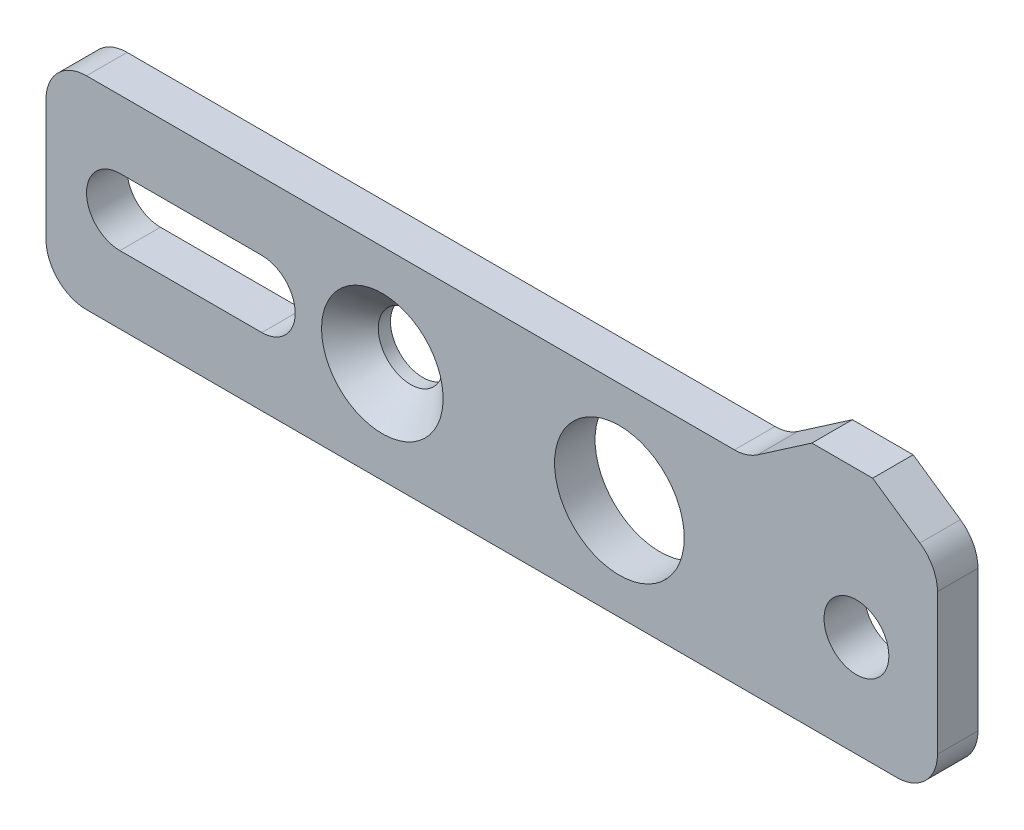
ISO-10303-21;
HEADER;
FILE_DESCRIPTION(('STEP AP214'),'2;1');
FILE_NAME('part.step','',(''),(''),'','','');
FILE_SCHEMA(('AUTOMOTIVE_DESIGN { 1 0 10303 214 1 1 1 1 }'));
ENDSEC;
DATA;
#1=APPLICATION_CONTEXT('core data for automotive mechanical design processes');
#2=APPLICATION_PROTOCOL_DEFINITION('international standard','automotive_design',2000,#1);
#3=PRODUCT_CONTEXT('',#1,'mechanical');
#4=PRODUCT('Part','Part','',(#3));
#5=PRODUCT_RELATED_PRODUCT_CATEGORY('part','',(#4));
#6=PRODUCT_DEFINITION_FORMATION('','',#4);
#7=PRODUCT_DEFINITION_CONTEXT('part definition',#1,'design');
#8=PRODUCT_DEFINITION('design','',#6,#7);
#9=PRODUCT_DEFINITION_SHAPE('','',#8);
#10=(LENGTH_UNIT() NAMED_UNIT(*) SI_UNIT(.MILLI.,.METRE.));
#11=(NAMED_UNIT(*) PLANE_ANGLE_UNIT() SI_UNIT($,.RADIAN.));
#12=(NAMED_UNIT(*) SI_UNIT($,.STERADIAN.) SOLID_ANGLE_UNIT());
#13=UNCERTAINTY_MEASURE_WITH_UNIT(LENGTH_MEASURE(1.E-05),#10,'distance_accuracy_value','');
#14=(GEOMETRIC_REPRESENTATION_CONTEXT(3) GLOBAL_UNCERTAINTY_ASSIGNED_CONTEXT((#13)) GLOBAL_UNIT_ASSIGNED_CONTEXT((#10,
#11,#12)) REPRESENTATION_CONTEXT('',''));
#15=CARTESIAN_POINT('',(0.,0.,0.));
#16=DIRECTION('',(0.,0.,1.));
#17=DIRECTION('',(1.,0.,0.));
#18=AXIS2_PLACEMENT_3D('',#15,#16,#17);
#19=CARTESIAN_POINT('',(62.9999999999999,25.,-10.));
#20=DIRECTION('',(0.,1.,0.));
#21=DIRECTION('',(-1.,0.,0.));
#22=AXIS2_PLACEMENT_3D('',#19,#20,#21);
#23=PLANE('',#22);
#24=DIRECTION('',(-1.,0.,0.));
#25=VECTOR('',#24,1.);
#26=CARTESIAN_POINT('',(62.9999999999999,25.,0.));
#27=LINE('',#26,#25);
#28=CARTESIAN_POINT('',(59.894101964593,25.,0.));
#29=VERTEX_POINT('',#28);
#30=CARTESIAN_POINT('',(-100.,25.,0.));
#31=VERTEX_POINT('',#30);
#32=EDGE_CURVE('E198',#29,#31,#27,.T.);
#33=ORIENTED_EDGE('',*,*,#32,.F.);
#34=DIRECTION('',(0.,0.,1.));
#35=VECTOR('',#34,1.);
#36=CARTESIAN_POINT('',(59.894101964593,25.,-10.));
#37=LINE('',#36,#35);
#38=CARTESIAN_POINT('',(59.894101964593,25.,-10.));
#39=VERTEX_POINT('',#38);
#40=EDGE_CURVE('E257',#29,#39,#37,.F.);
#41=ORIENTED_EDGE('',*,*,#40,.T.);
#42=DIRECTION('',(-1.,0.,0.));
#43=VECTOR('',#42,1.);
#44=CARTESIAN_POINT('',(62.9999999999999,25.,-10.));
#45=LINE('',#44,#43);
#46=CARTESIAN_POINT('',(-100.,25.,-10.));
#47=VERTEX_POINT('',#46);
#48=EDGE_CURVE('E202',#39,#47,#45,.T.);
#49=ORIENTED_EDGE('',*,*,#48,.T.);
#50=DIRECTION('',(0.,0.,1.));
#51=VECTOR('',#50,1.);
#52=CARTESIAN_POINT('',(-100.,25.,-10.));
#53=LINE('',#52,#51);
#54=EDGE_CURVE('E254',#47,#31,#53,.T.);
#55=ORIENTED_EDGE('',*,*,#54,.T.);
#56=EDGE_LOOP('',(#33,#41,#49,#55));
#57=FACE_BOUND('',#56,.T.);
#58=ADVANCED_FACE('F42',(#57),#23,.T.);
#59=CARTESIAN_POINT('',(78.9999999999999,36.0000000000001,-10.));
#60=DIRECTION('',(-0.566528822887066,0.824041924199367,0.));
#61=DIRECTION('',(-0.824041924199367,-0.566528822887066,0.));
#62=AXIS2_PLACEMENT_3D('',#59,#60,#61);
#63=PLANE('',#62);
#64=DIRECTION('',(-0.824041924199367,-0.566528822887066,0.));
#65=VECTOR('',#64,1.);
#66=CARTESIAN_POINT('',(78.9999999999999,36.0000000000001,-10.));
#67=LINE('',#66,#65);
#68=CARTESIAN_POINT('',(78.9999999999999,36.0000000000001,-10.));
#69=VERTEX_POINT('',#68);
#70=CARTESIAN_POINT('',(65.5593901934636,26.7595807580064,-10.));
#71=VERTEX_POINT('',#70);
#72=EDGE_CURVE('E219',#69,#71,#67,.T.);
#73=ORIENTED_EDGE('',*,*,#72,.T.);
#74=DIRECTION('',(0.,0.,1.));
#75=VECTOR('',#74,1.);
#76=CARTESIAN_POINT('',(65.5593901934636,26.7595807580064,0.));
#77=LINE('',#76,#75);
#78=CARTESIAN_POINT('',(65.5593901934636,26.7595807580064,0.));
#79=VERTEX_POINT('',#78);
#80=EDGE_CURVE('E251',#71,#79,#77,.T.);
#81=ORIENTED_EDGE('',*,*,#80,.T.);
#82=DIRECTION('',(-0.824041924199367,-0.566528822887066,0.));
#83=VECTOR('',#82,1.);
#84=CARTESIAN_POINT('',(78.9999999999999,36.0000000000001,0.));
#85=LINE('',#84,#83);
#86=CARTESIAN_POINT('',(78.9999999999999,36.0000000000001,0.));
#87=VERTEX_POINT('',#86);
#88=EDGE_CURVE('E206',#87,#79,#85,.T.);
#89=ORIENTED_EDGE('',*,*,#88,.F.);
#90=DIRECTION('',(0.,0.,1.));
#91=VECTOR('',#90,1.);
#92=CARTESIAN_POINT('',(78.9999999999999,36.0000000000001,-10.));
#93=LINE('',#92,#91);
#94=EDGE_CURVE('E241',#69,#87,#93,.T.);
#95=ORIENTED_EDGE('',*,*,#94,.F.);
#96=EDGE_LOOP('',(#73,#81,#89,#95));
#97=FACE_BOUND('',#96,.T.);
#98=ADVANCED_FACE('F305',(#97),#63,.T.);
#99=CARTESIAN_POINT('',(93.9999999999999,36.,-10.));
#100=DIRECTION('',(0.,1.,0.));
#101=DIRECTION('',(-1.,0.,0.));
#102=AXIS2_PLACEMENT_3D('',#99,#100,#101);
#103=PLANE('',#102);
#104=DIRECTION('',(-1.,0.,0.));
#105=VECTOR('',#104,1.);
#106=CARTESIAN_POINT('',(93.9999999999999,36.,0.));
#107=LINE('',#106,#105);
#108=CARTESIAN_POINT('',(93.9999999999999,36.,0.));
#109=VERTEX_POINT('',#108);
#110=EDGE_CURVE('E236',#109,#87,#107,.T.);
#111=ORIENTED_EDGE('',*,*,#110,.F.);
#112=DIRECTION('',(0.,0.,1.));
#113=VECTOR('',#112,1.);
#114=CARTESIAN_POINT('',(93.9999999999999,36.,-10.));
#115=LINE('',#114,#113);
#116=CARTESIAN_POINT('',(93.9999999999999,36.,-10.));
#117=VERTEX_POINT('',#116);
#118=EDGE_CURVE('E222',#117,#109,#115,.T.);
#119=ORIENTED_EDGE('',*,*,#118,.F.);
#120=DIRECTION('',(-1.,0.,0.));
#121=VECTOR('',#120,1.);
#122=CARTESIAN_POINT('',(93.9999999999999,36.,-10.));
#123=LINE('',#122,#121);
#124=EDGE_CURVE('E216',#117,#69,#123,.T.);
#125=ORIENTED_EDGE('',*,*,#124,.T.);
#126=ORIENTED_EDGE('',*,*,#94,.T.);
#127=EDGE_LOOP('',(#111,#119,#125,#126));
#128=FACE_BOUND('',#127,.T.);
#129=ADVANCED_FACE('F309',(#128),#103,.T.);
#130=CARTESIAN_POINT('',(110.,25.0000000000001,-10.));
#131=DIRECTION('',(0.566528822887065,0.824041924199368,0.));
#132=DIRECTION('',(-0.824041924199368,0.566528822887065,0.));
#133=AXIS2_PLACEMENT_3D('',#130,#131,#132);
#134=PLANE('',#133);
#135=DIRECTION('',(-0.824041924199368,0.566528822887065,0.));
#136=VECTOR('',#135,1.);
#137=CARTESIAN_POINT('',(110.,25.0000000000001,0.));
#138=LINE('',#137,#136);
#139=CARTESIAN_POINT('',(105.665288228871,27.9801143426515,0.));
#140=VERTEX_POINT('',#139);
#141=EDGE_CURVE('E234',#140,#109,#138,.T.);
#142=ORIENTED_EDGE('',*,*,#141,.F.);
#143=DIRECTION('',(0.,0.,1.));
#144=VECTOR('',#143,1.);
#145=CARTESIAN_POINT('',(105.665288228871,27.9801143426515,-10.));
#146=LINE('',#145,#144);
#147=CARTESIAN_POINT('',(105.665288228871,27.9801143426515,-10.));
#148=VERTEX_POINT('',#147);
#149=EDGE_CURVE('E272',#140,#148,#146,.F.);
#150=ORIENTED_EDGE('',*,*,#149,.T.);
#151=DIRECTION('',(-0.824041924199368,0.566528822887065,0.));
#152=VECTOR('',#151,1.);
#153=CARTESIAN_POINT('',(110.,25.0000000000001,-10.));
#154=LINE('',#153,#152);
#155=EDGE_CURVE('E214',#148,#117,#154,.T.);
#156=ORIENTED_EDGE('',*,*,#155,.T.);
#157=ORIENTED_EDGE('',*,*,#118,.T.);
#158=EDGE_LOOP('',(#142,#150,#156,#157));
#159=FACE_BOUND('',#158,.T.);
#160=ADVANCED_FACE('F452',(#159),#134,.T.);
#161=CARTESIAN_POINT('',(110.,-25.,-10.));
#162=DIRECTION('',(1.,0.,0.));
#163=DIRECTION('',(0.,1.,0.));
#164=AXIS2_PLACEMENT_3D('',#161,#162,#163);
#165=PLANE('',#164);
#166=DIRECTION('',(0.,1.,0.));
#167=VECTOR('',#166,1.);
#168=CARTESIAN_POINT('',(110.,-25.,-10.));
#169=LINE('',#168,#167);
#170=CARTESIAN_POINT('',(110.,-15.,-10.));
#171=VERTEX_POINT('',#170);
#172=CARTESIAN_POINT('',(110.,19.7396951006578,-10.));
#173=VERTEX_POINT('',#172);
#174=EDGE_CURVE('E211',#171,#173,#169,.T.);
#175=ORIENTED_EDGE('',*,*,#174,.T.);
#176=DIRECTION('',(0.,0.,1.));
#177=VECTOR('',#176,1.);
#178=CARTESIAN_POINT('',(110.,19.7396951006578,-10.));
#179=LINE('',#178,#177);
#180=CARTESIAN_POINT('',(110.,19.7396951006578,0.));
#181=VERTEX_POINT('',#180);
#182=EDGE_CURVE('E261',#173,#181,#179,.T.);
#183=ORIENTED_EDGE('',*,*,#182,.T.);
#184=DIRECTION('',(0.,1.,0.));
#185=VECTOR('',#184,1.);
#186=CARTESIAN_POINT('',(110.,-25.,0.));
#187=LINE('',#186,#185);
#188=CARTESIAN_POINT('',(110.,-15.,0.));
#189=VERTEX_POINT('',#188);
#190=EDGE_CURVE('E231',#189,#181,#187,.T.);
#191=ORIENTED_EDGE('',*,*,#190,.F.);
#192=DIRECTION('',(0.,0.,1.));
#193=VECTOR('',#192,1.);
#194=CARTESIAN_POINT('',(110.,-15.,-10.));
#195=LINE('',#194,#193);
#196=EDGE_CURVE('E259',#189,#171,#195,.F.);
#197=ORIENTED_EDGE('',*,*,#196,.T.);
#198=EDGE_LOOP('',(#175,#183,#191,#197));
#199=FACE_BOUND('',#198,.T.);
#200=ADVANCED_FACE('F319',(#199),#165,.T.);
#201=CARTESIAN_POINT('',(110.,-25.,-10.));
#202=DIRECTION('',(0.,-1.,0.));
#203=DIRECTION('',(1.,0.,0.));
#204=AXIS2_PLACEMENT_3D('',#201,#202,#203);
#205=PLANE('',#204);
#206=DIRECTION('',(1.,0.,0.));
#207=VECTOR('',#206,1.);
#208=CARTESIAN_POINT('',(110.,-25.,-10.));
#209=LINE('',#208,#207);
#210=CARTESIAN_POINT('',(-100.,-25.,-10.));
#211=VERTEX_POINT('',#210);
#212=CARTESIAN_POINT('',(99.9999999999999,-25.,-10.));
#213=VERTEX_POINT('',#212);
#214=EDGE_CURVE('E208',#211,#213,#209,.T.);
#215=ORIENTED_EDGE('',*,*,#214,.T.);
#216=DIRECTION('',(0.,0.,1.));
#217=VECTOR('',#216,1.);
#218=CARTESIAN_POINT('',(99.9999999999999,-25.,-10.));
#219=LINE('',#218,#217);
#220=CARTESIAN_POINT('',(99.9999999999999,-25.,0.));
#221=VERTEX_POINT('',#220);
#222=EDGE_CURVE('E283',#213,#221,#219,.T.);
#223=ORIENTED_EDGE('',*,*,#222,.T.);
#224=DIRECTION('',(1.,0.,0.));
#225=VECTOR('',#224,1.);
#226=CARTESIAN_POINT('',(110.,-25.,0.));
#227=LINE('',#226,#225);
#228=CARTESIAN_POINT('',(-100.,-25.,0.));
#229=VERTEX_POINT('',#228);
#230=EDGE_CURVE('E228',#229,#221,#227,.T.);
#231=ORIENTED_EDGE('',*,*,#230,.F.);
#232=DIRECTION('',(0.,0.,1.));
#233=VECTOR('',#232,1.);
#234=CARTESIAN_POINT('',(-100.,-25.,-10.));
#235=LINE('',#234,#233);
#236=EDGE_CURVE('E281',#229,#211,#235,.F.);
#237=ORIENTED_EDGE('',*,*,#236,.T.);
#238=EDGE_LOOP('',(#215,#223,#231,#237));
#239=FACE_BOUND('',#238,.T.);
#240=ADVANCED_FACE('F328',(#239),#205,.T.);
#241=CARTESIAN_POINT('',(-110.,-25.,-10.));
#242=DIRECTION('',(-1.,0.,0.));
#243=DIRECTION('',(0.,-1.,0.));
#244=AXIS2_PLACEMENT_3D('',#241,#242,#243);
#245=PLANE('',#244);
#246=DIRECTION('',(0.,-1.,0.));
#247=VECTOR('',#246,1.);
#248=CARTESIAN_POINT('',(-110.,-25.,-10.));
#249=LINE('',#248,#247);
#250=CARTESIAN_POINT('',(-110.,15.,-10.));
#251=VERTEX_POINT('',#250);
#252=CARTESIAN_POINT('',(-110.,-15.,-10.));
#253=VERTEX_POINT('',#252);
#254=EDGE_CURVE('E205',#251,#253,#249,.T.);
#255=ORIENTED_EDGE('',*,*,#254,.T.);
#256=DIRECTION('',(0.,0.,1.));
#257=VECTOR('',#256,1.);
#258=CARTESIAN_POINT('',(-110.,-15.,-10.));
#259=LINE('',#258,#257);
#260=CARTESIAN_POINT('',(-110.,-15.,0.));
#261=VERTEX_POINT('',#260);
#262=EDGE_CURVE('E287',#253,#261,#259,.T.);
#263=ORIENTED_EDGE('',*,*,#262,.T.);
#264=DIRECTION('',(0.,-1.,0.));
#265=VECTOR('',#264,1.);
#266=CARTESIAN_POINT('',(-110.,-25.,0.));
#267=LINE('',#266,#265);
#268=CARTESIAN_POINT('',(-110.,15.,0.));
#269=VERTEX_POINT('',#268);
#270=EDGE_CURVE('E225',#269,#261,#267,.T.);
#271=ORIENTED_EDGE('',*,*,#270,.F.);
#272=DIRECTION('',(0.,0.,1.));
#273=VECTOR('',#272,1.);
#274=CARTESIAN_POINT('',(-110.,15.,-10.));
#275=LINE('',#274,#273);
#276=EDGE_CURVE('E64',#269,#251,#275,.F.);
#277=ORIENTED_EDGE('',*,*,#276,.T.);
#278=EDGE_LOOP('',(#255,#263,#271,#277));
#279=FACE_BOUND('',#278,.T.);
#280=ADVANCED_FACE('F333',(#279),#245,.T.);
#281=CARTESIAN_POINT('',(0.,0.,-10.));
#282=DIRECTION('',(0.,0.,-1.));
#283=DIRECTION('',(-1.,0.,0.));
#284=AXIS2_PLACEMENT_3D('',#281,#282,#283);
#285=PLANE('',#284);
#286=CARTESIAN_POINT('',(31.4999999999999,0.,-10.));
#287=DIRECTION('',(0.,0.,1.));
#288=DIRECTION('',(1.,0.,0.));
#289=AXIS2_PLACEMENT_3D('',#286,#287,#288);
#290=CIRCLE('',#289,16.);
#291=CARTESIAN_POINT('',(47.4999999999999,0.,-10.));
#292=VERTEX_POINT('',#291);
#293=EDGE_CURVE('E567',#292,#292,#290,.T.);
#294=ORIENTED_EDGE('',*,*,#293,.T.);
#295=EDGE_LOOP('',(#294));
#296=FACE_BOUND('',#295,.T.);
#297=CARTESIAN_POINT('',(-27.0000000000001,0.,-10.));
#298=DIRECTION('',(0.,0.,1.));
#299=DIRECTION('',(1.,0.,0.));
#300=AXIS2_PLACEMENT_3D('',#297,#298,#299);
#301=CIRCLE('',#300,8.);
#302=CARTESIAN_POINT('',(-19.0000000000001,0.,-10.));
#303=VERTEX_POINT('',#302);
#304=EDGE_CURVE('E564',#303,#303,#301,.T.);
#305=ORIENTED_EDGE('',*,*,#304,.T.);
#306=EDGE_LOOP('',(#305));
#307=FACE_BOUND('',#306,.T.);
#308=CARTESIAN_POINT('',(89.9999999999999,0.,-10.));
#309=DIRECTION('',(0.,0.,1.));
#310=DIRECTION('',(1.,0.,0.));
#311=AXIS2_PLACEMENT_3D('',#308,#309,#310);
#312=CIRCLE('',#311,7.99999999999999);
#313=CARTESIAN_POINT('',(97.9999999999999,0.,-10.));
#314=VERTEX_POINT('',#313);
#315=EDGE_CURVE('E186',#314,#314,#312,.T.);
#316=ORIENTED_EDGE('',*,*,#315,.T.);
#317=EDGE_LOOP('',(#316));
#318=FACE_BOUND('',#317,.T.);
#319=CARTESIAN_POINT('',(-91.75,0.,-10.));
#320=DIRECTION('',(0.,0.,1.));
#321=DIRECTION('',(1.,0.,0.));
#322=AXIS2_PLACEMENT_3D('',#319,#320,#321);
#323=CIRCLE('',#322,8.25);
#324=CARTESIAN_POINT('',(-91.75,8.25,-10.));
#325=VERTEX_POINT('',#324);
#326=CARTESIAN_POINT('',(-91.75,-8.25,-10.));
#327=VERTEX_POINT('',#326);
#328=EDGE_CURVE('E160',#325,#327,#323,.T.);
#329=ORIENTED_EDGE('',*,*,#328,.T.);
#330=DIRECTION('',(1.,0.,0.));
#331=VECTOR('',#330,1.);
#332=CARTESIAN_POINT('',(-91.75,-8.25,-10.));
#333=LINE('',#332,#331);
#334=CARTESIAN_POINT('',(-56.75,-8.25,-10.));
#335=VERTEX_POINT('',#334);
#336=EDGE_CURVE('E172',#327,#335,#333,.T.);
#337=ORIENTED_EDGE('',*,*,#336,.T.);
#338=CARTESIAN_POINT('',(-56.75,0.,-10.));
#339=DIRECTION('',(0.,0.,1.));
#340=DIRECTION('',(1.,0.,0.));
#341=AXIS2_PLACEMENT_3D('',#338,#339,#340);
#342=CIRCLE('',#341,8.25);
#343=CARTESIAN_POINT('',(-56.75,8.25,-10.));
#344=VERTEX_POINT('',#343);
#345=EDGE_CURVE('E176',#335,#344,#342,.T.);
#346=ORIENTED_EDGE('',*,*,#345,.T.);
#347=DIRECTION('',(-1.,0.,0.));
#348=VECTOR('',#347,1.);
#349=CARTESIAN_POINT('',(-91.75,8.25,-10.));
#350=LINE('',#349,#348);
#351=EDGE_CURVE('E168',#344,#325,#350,.T.);
#352=ORIENTED_EDGE('',*,*,#351,.T.);
#353=EDGE_LOOP('',(#329,#337,#346,#352));
#354=FACE_BOUND('',#353,.T.);
#355=ORIENTED_EDGE('',*,*,#155,.F.);
#356=CARTESIAN_POINT('',(99.9999999999999,19.7396951006578,-10.));
#357=DIRECTION('',(0.,0.,-1.));
#358=DIRECTION('',(-1.,0.,0.));
#359=AXIS2_PLACEMENT_3D('',#356,#357,#358);
#360=CIRCLE('',#359,10.);
#361=EDGE_CURVE('E279',#148,#173,#360,.T.);
#362=ORIENTED_EDGE('',*,*,#361,.T.);
#363=ORIENTED_EDGE('',*,*,#174,.F.);
#364=CARTESIAN_POINT('',(99.9999999999999,-15.,-10.));
#365=DIRECTION('',(0.,0.,-1.));
#366=DIRECTION('',(-1.,0.,0.));
#367=AXIS2_PLACEMENT_3D('',#364,#365,#366);
#368=CIRCLE('',#367,10.);
#369=EDGE_CURVE('E277',#171,#213,#368,.T.);
#370=ORIENTED_EDGE('',*,*,#369,.T.);
#371=ORIENTED_EDGE('',*,*,#214,.F.);
#372=CARTESIAN_POINT('',(-100.,-15.,-10.));
#373=DIRECTION('',(0.,0.,-1.));
#374=DIRECTION('',(-1.,0.,0.));
#375=AXIS2_PLACEMENT_3D('',#372,#373,#374);
#376=CIRCLE('',#375,10.);
#377=EDGE_CURVE('E57',#211,#253,#376,.T.);
#378=ORIENTED_EDGE('',*,*,#377,.T.);
#379=ORIENTED_EDGE('',*,*,#254,.F.);
#380=CARTESIAN_POINT('',(-100.,15.,-10.));
#381=DIRECTION('',(0.,0.,-1.));
#382=DIRECTION('',(-1.,0.,0.));
#383=AXIS2_PLACEMENT_3D('',#380,#381,#382);
#384=CIRCLE('',#383,10.);
#385=EDGE_CURVE('E274',#251,#47,#384,.T.);
#386=ORIENTED_EDGE('',*,*,#385,.T.);
#387=ORIENTED_EDGE('',*,*,#48,.F.);
#388=CARTESIAN_POINT('',(59.894101964593,35.,-10.));
#389=DIRECTION('',(0.,0.,-1.));
#390=DIRECTION('',(-1.,0.,0.));
#391=AXIS2_PLACEMENT_3D('',#388,#389,#390);
#392=CIRCLE('',#391,10.);
#393=EDGE_CURVE('E11',#39,#71,#392,.F.);
#394=ORIENTED_EDGE('',*,*,#393,.T.);
#395=ORIENTED_EDGE('',*,*,#72,.F.);
#396=ORIENTED_EDGE('',*,*,#124,.F.);
#397=EDGE_LOOP('',(#355,#362,#363,#370,#371,#378,#379,#386,#387,#394,#395,#396));
#398=FACE_BOUND('',#397,.T.);
#399=ADVANCED_FACE('F178',(#296,#307,#318,#354,#398),#285,.T.);
#400=CARTESIAN_POINT('',(0.,0.,0.));
#401=DIRECTION('',(0.,0.,-1.));
#402=DIRECTION('',(-1.,0.,0.));
#403=AXIS2_PLACEMENT_3D('',#400,#401,#402);
#404=PLANE('',#403);
#405=CARTESIAN_POINT('',(-27.0000000000001,0.,0.));
#406=DIRECTION('',(0.,0.,-1.));
#407=DIRECTION('',(-1.,0.,0.));
#408=AXIS2_PLACEMENT_3D('',#405,#406,#407);
#409=CIRCLE('',#408,15.);
#410=CARTESIAN_POINT('',(-42.0000000000001,0.,0.));
#411=VERTEX_POINT('',#410);
#412=EDGE_CURVE('E248',#411,#411,#409,.T.);
#413=ORIENTED_EDGE('',*,*,#412,.T.);
#414=EDGE_LOOP('',(#413));
#415=FACE_BOUND('',#414,.T.);
#416=CARTESIAN_POINT('',(31.4999999999999,0.,0.));
#417=DIRECTION('',(0.,0.,1.));
#418=DIRECTION('',(1.,0.,0.));
#419=AXIS2_PLACEMENT_3D('',#416,#417,#418);
#420=CIRCLE('',#419,16.);
#421=CARTESIAN_POINT('',(47.4999999999999,0.,0.));
#422=VERTEX_POINT('',#421);
#423=EDGE_CURVE('E571',#422,#422,#420,.T.);
#424=ORIENTED_EDGE('',*,*,#423,.F.);
#425=EDGE_LOOP('',(#424));
#426=FACE_BOUND('',#425,.T.);
#427=CARTESIAN_POINT('',(89.9999999999999,0.,0.));
#428=DIRECTION('',(0.,0.,1.));
#429=DIRECTION('',(1.,0.,0.));
#430=AXIS2_PLACEMENT_3D('',#427,#428,#429);
#431=CIRCLE('',#430,7.99999999999999);
#432=CARTESIAN_POINT('',(97.9999999999999,0.,0.));
#433=VERTEX_POINT('',#432);
#434=EDGE_CURVE('E566',#433,#433,#431,.T.);
#435=ORIENTED_EDGE('',*,*,#434,.F.);
#436=EDGE_LOOP('',(#435));
#437=FACE_BOUND('',#436,.T.);
#438=DIRECTION('',(1.,0.,0.));
#439=VECTOR('',#438,1.);
#440=CARTESIAN_POINT('',(-91.75,-8.25,0.));
#441=LINE('',#440,#439);
#442=CARTESIAN_POINT('',(-91.75,-8.25,0.));
#443=VERTEX_POINT('',#442);
#444=CARTESIAN_POINT('',(-56.75,-8.25,0.));
#445=VERTEX_POINT('',#444);
#446=EDGE_CURVE('E192',#443,#445,#441,.T.);
#447=ORIENTED_EDGE('',*,*,#446,.F.);
#448=CARTESIAN_POINT('',(-91.75,0.,0.));
#449=DIRECTION('',(0.,0.,1.));
#450=DIRECTION('',(1.,0.,0.));
#451=AXIS2_PLACEMENT_3D('',#448,#449,#450);
#452=CIRCLE('',#451,8.25);
#453=CARTESIAN_POINT('',(-91.75,8.25,0.));
#454=VERTEX_POINT('',#453);
#455=EDGE_CURVE('E163',#454,#443,#452,.T.);
#456=ORIENTED_EDGE('',*,*,#455,.F.);
#457=DIRECTION('',(-1.,0.,0.));
#458=VECTOR('',#457,1.);
#459=CARTESIAN_POINT('',(-91.75,8.25,0.));
#460=LINE('',#459,#458);
#461=CARTESIAN_POINT('',(-56.75,8.25,0.));
#462=VERTEX_POINT('',#461);
#463=EDGE_CURVE('E180',#462,#454,#460,.T.);
#464=ORIENTED_EDGE('',*,*,#463,.F.);
#465=CARTESIAN_POINT('',(-56.75,0.,0.));
#466=DIRECTION('',(0.,0.,1.));
#467=DIRECTION('',(1.,0.,0.));
#468=AXIS2_PLACEMENT_3D('',#465,#466,#467);
#469=CIRCLE('',#468,8.25);
#470=EDGE_CURVE('E183',#445,#462,#469,.T.);
#471=ORIENTED_EDGE('',*,*,#470,.F.);
#472=EDGE_LOOP('',(#447,#456,#464,#471));
#473=FACE_BOUND('',#472,.T.);
#474=ORIENTED_EDGE('',*,*,#190,.T.);
#475=CARTESIAN_POINT('',(99.9999999999999,19.7396951006578,0.));
#476=DIRECTION('',(0.,0.,-1.));
#477=DIRECTION('',(-1.,0.,0.));
#478=AXIS2_PLACEMENT_3D('',#475,#476,#477);
#479=CIRCLE('',#478,10.);
#480=EDGE_CURVE('E270',#181,#140,#479,.F.);
#481=ORIENTED_EDGE('',*,*,#480,.T.);
#482=ORIENTED_EDGE('',*,*,#141,.T.);
#483=ORIENTED_EDGE('',*,*,#110,.T.);
#484=ORIENTED_EDGE('',*,*,#88,.T.);
#485=CARTESIAN_POINT('',(59.894101964593,35.,0.));
#486=DIRECTION('',(0.,0.,-1.));
#487=DIRECTION('',(-1.,0.,0.));
#488=AXIS2_PLACEMENT_3D('',#485,#486,#487);
#489=CIRCLE('',#488,10.);
#490=EDGE_CURVE('E50',#79,#29,#489,.T.);
#491=ORIENTED_EDGE('',*,*,#490,.T.);
#492=ORIENTED_EDGE('',*,*,#32,.T.);
#493=CARTESIAN_POINT('',(-100.,15.,0.));
#494=DIRECTION('',(0.,0.,-1.));
#495=DIRECTION('',(-1.,0.,0.));
#496=AXIS2_PLACEMENT_3D('',#493,#494,#495);
#497=CIRCLE('',#496,10.);
#498=EDGE_CURVE('E264',#31,#269,#497,.F.);
#499=ORIENTED_EDGE('',*,*,#498,.T.);
#500=ORIENTED_EDGE('',*,*,#270,.T.);
#501=CARTESIAN_POINT('',(-100.,-15.,0.));
#502=DIRECTION('',(0.,0.,-1.));
#503=DIRECTION('',(-1.,0.,0.));
#504=AXIS2_PLACEMENT_3D('',#501,#502,#503);
#505=CIRCLE('',#504,10.);
#506=EDGE_CURVE('E266',#261,#229,#505,.F.);
#507=ORIENTED_EDGE('',*,*,#506,.T.);
#508=ORIENTED_EDGE('',*,*,#230,.T.);
#509=CARTESIAN_POINT('',(99.9999999999999,-15.,0.));
#510=DIRECTION('',(0.,0.,-1.));
#511=DIRECTION('',(-1.,0.,0.));
#512=AXIS2_PLACEMENT_3D('',#509,#510,#511);
#513=CIRCLE('',#512,10.);
#514=EDGE_CURVE('E268',#221,#189,#513,.F.);
#515=ORIENTED_EDGE('',*,*,#514,.T.);
#516=EDGE_LOOP('',(#474,#481,#482,#483,#484,#491,#492,#499,#500,#507,#508,#515));
#517=FACE_BOUND('',#516,.T.);
#518=ADVANCED_FACE('F291',(#415,#426,#437,#473,#517),#404,.F.);
#519=CARTESIAN_POINT('',(-91.75,0.,-10.));
#520=DIRECTION('',(0.,0.,1.));
#521=DIRECTION('',(1.,0.,0.));
#522=AXIS2_PLACEMENT_3D('',#519,#520,#521);
#523=CYLINDRICAL_SURFACE('',#522,8.25);
#524=ORIENTED_EDGE('',*,*,#455,.T.);
#525=DIRECTION('',(0.,0.,1.));
#526=VECTOR('',#525,1.);
#527=CARTESIAN_POINT('',(-91.75,-8.25,-10.));
#528=LINE('',#527,#526);
#529=EDGE_CURVE('E156',#327,#443,#528,.T.);
#530=ORIENTED_EDGE('',*,*,#529,.F.);
#531=ORIENTED_EDGE('',*,*,#328,.F.);
#532=DIRECTION('',(0.,0.,1.));
#533=VECTOR('',#532,1.);
#534=CARTESIAN_POINT('',(-91.75,8.25,-10.));
#535=LINE('',#534,#533);
#536=EDGE_CURVE('E196',#325,#454,#535,.T.);
#537=ORIENTED_EDGE('',*,*,#536,.T.);
#538=EDGE_LOOP('',(#524,#530,#531,#537));
#539=FACE_BOUND('',#538,.T.);
#540=ADVANCED_FACE('F158',(#539),#523,.F.);
#541=CARTESIAN_POINT('',(-91.75,8.25,-10.));
#542=DIRECTION('',(0.,1.,0.));
#543=DIRECTION('',(0.,0.,1.));
#544=AXIS2_PLACEMENT_3D('',#541,#542,#543);
#545=PLANE('',#544);
#546=ORIENTED_EDGE('',*,*,#463,.T.);
#547=ORIENTED_EDGE('',*,*,#536,.F.);
#548=ORIENTED_EDGE('',*,*,#351,.F.);
#549=DIRECTION('',(0.,0.,1.));
#550=VECTOR('',#549,1.);
#551=CARTESIAN_POINT('',(-56.75,8.25,-10.));
#552=LINE('',#551,#550);
#553=EDGE_CURVE('E199',#344,#462,#552,.T.);
#554=ORIENTED_EDGE('',*,*,#553,.T.);
#555=EDGE_LOOP('',(#546,#547,#548,#554));
#556=FACE_BOUND('',#555,.T.);
#557=ADVANCED_FACE('F478',(#556),#545,.F.);
#558=CARTESIAN_POINT('',(-56.75,0.,-10.));
#559=DIRECTION('',(0.,0.,1.));
#560=DIRECTION('',(1.,0.,0.));
#561=AXIS2_PLACEMENT_3D('',#558,#559,#560);
#562=CYLINDRICAL_SURFACE('',#561,8.25);
#563=ORIENTED_EDGE('',*,*,#470,.T.);
#564=ORIENTED_EDGE('',*,*,#553,.F.);
#565=ORIENTED_EDGE('',*,*,#345,.F.);
#566=DIRECTION('',(0.,0.,1.));
#567=VECTOR('',#566,1.);
#568=CARTESIAN_POINT('',(-56.75,-8.25,-10.));
#569=LINE('',#568,#567);
#570=EDGE_CURVE('E167',#335,#445,#569,.T.);
#571=ORIENTED_EDGE('',*,*,#570,.T.);
#572=EDGE_LOOP('',(#563,#564,#565,#571));
#573=FACE_BOUND('',#572,.T.);
#574=ADVANCED_FACE('F488',(#573),#562,.F.);
#575=CARTESIAN_POINT('',(-91.75,-8.25,-10.));
#576=DIRECTION('',(0.,-1.,0.));
#577=DIRECTION('',(0.,0.,-1.));
#578=AXIS2_PLACEMENT_3D('',#575,#576,#577);
#579=PLANE('',#578);
#580=ORIENTED_EDGE('',*,*,#446,.T.);
#581=ORIENTED_EDGE('',*,*,#570,.F.);
#582=ORIENTED_EDGE('',*,*,#336,.F.);
#583=ORIENTED_EDGE('',*,*,#529,.T.);
#584=EDGE_LOOP('',(#580,#581,#582,#583));
#585=FACE_BOUND('',#584,.T.);
#586=ADVANCED_FACE('F173',(#585),#579,.F.);
#587=CARTESIAN_POINT('',(89.9999999999999,0.,0.));
#588=DIRECTION('',(0.,0.,1.));
#589=DIRECTION('',(1.,0.,0.));
#590=AXIS2_PLACEMENT_3D('',#587,#588,#589);
#591=CYLINDRICAL_SURFACE('',#590,7.99999999999999);
#592=ORIENTED_EDGE('',*,*,#315,.F.);
#593=EDGE_LOOP('',(#592));
#594=FACE_BOUND('',#593,.T.);
#595=ORIENTED_EDGE('',*,*,#434,.T.);
#596=EDGE_LOOP('',(#595));
#597=FACE_BOUND('',#596,.T.);
#598=ADVANCED_FACE('F509',(#594,#597),#591,.F.);
#599=CARTESIAN_POINT('',(-27.0000000000001,0.,0.));
#600=DIRECTION('',(0.,0.,1.));
#601=DIRECTION('',(1.,0.,0.));
#602=AXIS2_PLACEMENT_3D('',#599,#600,#601);
#603=CYLINDRICAL_SURFACE('',#602,8.);
#604=CARTESIAN_POINT('',(-27.0000000000001,0.,-6.99999999999996));
#605=DIRECTION('',(0.,0.,-1.));
#606=DIRECTION('',(-1.,0.,0.));
#607=AXIS2_PLACEMENT_3D('',#604,#605,#606);
#608=CIRCLE('',#607,8.);
#609=CARTESIAN_POINT('',(-35.0000000000001,0.,-6.99999999999996));
#610=VERTEX_POINT('',#609);
#611=EDGE_CURVE('E243',#610,#610,#608,.F.);
#612=ORIENTED_EDGE('',*,*,#611,.T.);
#613=EDGE_LOOP('',(#612));
#614=FACE_BOUND('',#613,.T.);
#615=ORIENTED_EDGE('',*,*,#304,.F.);
#616=EDGE_LOOP('',(#615));
#617=FACE_BOUND('',#616,.T.);
#618=ADVANCED_FACE('F519',(#614,#617),#603,.F.);
#619=CARTESIAN_POINT('',(31.4999999999999,0.,0.));
#620=DIRECTION('',(0.,0.,1.));
#621=DIRECTION('',(1.,0.,0.));
#622=AXIS2_PLACEMENT_3D('',#619,#620,#621);
#623=CYLINDRICAL_SURFACE('',#622,16.);
#624=ORIENTED_EDGE('',*,*,#293,.F.);
#625=EDGE_LOOP('',(#624));
#626=FACE_BOUND('',#625,.T.);
#627=ORIENTED_EDGE('',*,*,#423,.T.);
#628=EDGE_LOOP('',(#627));
#629=FACE_BOUND('',#628,.T.);
#630=ADVANCED_FACE('F355',(#626,#629),#623,.F.);
#631=CARTESIAN_POINT('',(-27.0000000000001,0.,-6.99999999999996));
#632=DIRECTION('',(0.,0.,1.));
#633=DIRECTION('',(1.,0.,0.));
#634=AXIS2_PLACEMENT_3D('',#631,#632,#633);
#635=CONICAL_SURFACE('',#634,8.,0.78539816339745);
#636=ORIENTED_EDGE('',*,*,#412,.F.);
#637=EDGE_LOOP('',(#636));
#638=FACE_BOUND('',#637,.T.);
#639=ORIENTED_EDGE('',*,*,#611,.F.);
#640=EDGE_LOOP('',(#639));
#641=FACE_BOUND('',#640,.T.);
#642=ADVANCED_FACE('F350',(#638,#641),#635,.F.);
#643=CARTESIAN_POINT('',(59.894101964593,35.,-10.));
#644=DIRECTION('',(0.,0.,-1.));
#645=DIRECTION('',(-1.,0.,0.));
#646=AXIS2_PLACEMENT_3D('',#643,#644,#645);
#647=CYLINDRICAL_SURFACE('',#646,10.);
#648=ORIENTED_EDGE('',*,*,#393,.F.);
#649=ORIENTED_EDGE('',*,*,#40,.F.);
#650=ORIENTED_EDGE('',*,*,#490,.F.);
#651=ORIENTED_EDGE('',*,*,#80,.F.);
#652=EDGE_LOOP('',(#648,#649,#650,#651));
#653=FACE_BOUND('',#652,.T.);
#654=ADVANCED_FACE('F300',(#653),#647,.F.);
#655=CARTESIAN_POINT('',(99.9999999999999,19.7396951006578,-10.));
#656=DIRECTION('',(0.,0.,1.));
#657=DIRECTION('',(1.,0.,0.));
#658=AXIS2_PLACEMENT_3D('',#655,#656,#657);
#659=CYLINDRICAL_SURFACE('',#658,10.);
#660=ORIENTED_EDGE('',*,*,#361,.F.);
#661=ORIENTED_EDGE('',*,*,#149,.F.);
#662=ORIENTED_EDGE('',*,*,#480,.F.);
#663=ORIENTED_EDGE('',*,*,#182,.F.);
#664=EDGE_LOOP('',(#660,#661,#662,#663));
#665=FACE_BOUND('',#664,.T.);
#666=ADVANCED_FACE('F316',(#665),#659,.T.);
#667=CARTESIAN_POINT('',(99.9999999999999,-15.,-10.));
#668=DIRECTION('',(0.,0.,1.));
#669=DIRECTION('',(1.,0.,0.));
#670=AXIS2_PLACEMENT_3D('',#667,#668,#669);
#671=CYLINDRICAL_SURFACE('',#670,10.);
#672=ORIENTED_EDGE('',*,*,#369,.F.);
#673=ORIENTED_EDGE('',*,*,#196,.F.);
#674=ORIENTED_EDGE('',*,*,#514,.F.);
#675=ORIENTED_EDGE('',*,*,#222,.F.);
#676=EDGE_LOOP('',(#672,#673,#674,#675));
#677=FACE_BOUND('',#676,.T.);
#678=ADVANCED_FACE('F326',(#677),#671,.T.);
#679=CARTESIAN_POINT('',(-100.,-15.,-10.));
#680=DIRECTION('',(0.,0.,1.));
#681=DIRECTION('',(1.,0.,0.));
#682=AXIS2_PLACEMENT_3D('',#679,#680,#681);
#683=CYLINDRICAL_SURFACE('',#682,10.);
#684=ORIENTED_EDGE('',*,*,#377,.F.);
#685=ORIENTED_EDGE('',*,*,#236,.F.);
#686=ORIENTED_EDGE('',*,*,#506,.F.);
#687=ORIENTED_EDGE('',*,*,#262,.F.);
#688=EDGE_LOOP('',(#684,#685,#686,#687));
#689=FACE_BOUND('',#688,.T.);
#690=ADVANCED_FACE('F332',(#689),#683,.T.);
#691=CARTESIAN_POINT('',(-100.,15.,-10.));
#692=DIRECTION('',(0.,0.,1.));
#693=DIRECTION('',(1.,0.,0.));
#694=AXIS2_PLACEMENT_3D('',#691,#692,#693);
#695=CYLINDRICAL_SURFACE('',#694,10.);
#696=ORIENTED_EDGE('',*,*,#385,.F.);
#697=ORIENTED_EDGE('',*,*,#276,.F.);
#698=ORIENTED_EDGE('',*,*,#498,.F.);
#699=ORIENTED_EDGE('',*,*,#54,.F.);
#700=EDGE_LOOP('',(#696,#697,#698,#699));
#701=FACE_BOUND('',#700,.T.);
#702=ADVANCED_FACE('F44',(#701),#695,.T.);
#703=CLOSED_SHELL('',(#58,#98,#129,#160,#200,#240,#280,#399,#518,#540,#557,#574,#586,#598,#618,
#630,#642,#654,#666,#678,#690,#702));
#704=MANIFOLD_SOLID_BREP('B2',#703);
#705=ADVANCED_BREP_SHAPE_REPRESENTATION('',(#18,#704),#14);
#706=SHAPE_DEFINITION_REPRESENTATION(#9,#705);
ENDSEC;
END-ISO-10303-21;
